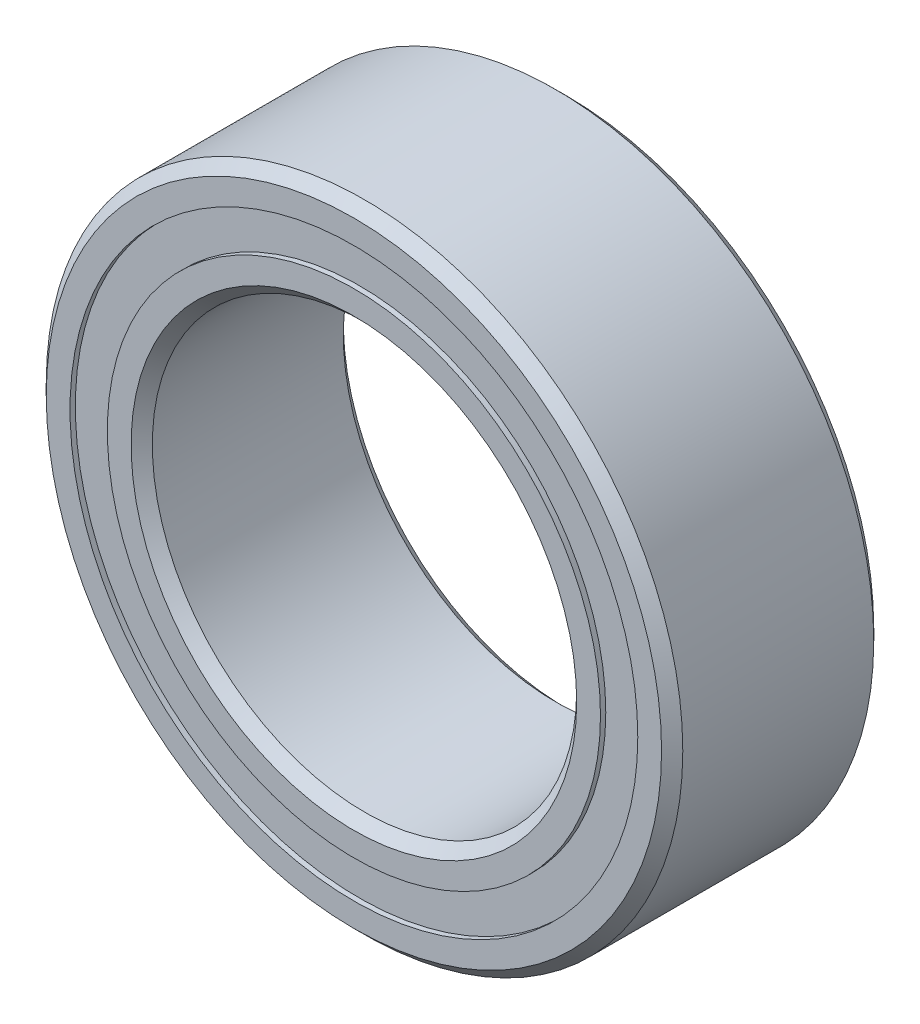
ISO-10303-21;
HEADER;
FILE_DESCRIPTION(('STEP AP214'),'2;1');
FILE_NAME('part.step','',(''),(''),'','','');
FILE_SCHEMA(('AUTOMOTIVE_DESIGN { 1 0 10303 214 1 1 1 1 }'));
ENDSEC;
DATA;
#1=APPLICATION_CONTEXT('core data for automotive mechanical design processes');
#2=APPLICATION_PROTOCOL_DEFINITION('international standard','automotive_design',2000,#1);
#3=PRODUCT_CONTEXT('',#1,'mechanical');
#4=PRODUCT('Part','Part','',(#3));
#5=PRODUCT_RELATED_PRODUCT_CATEGORY('part','',(#4));
#6=PRODUCT_DEFINITION_FORMATION('','',#4);
#7=PRODUCT_DEFINITION_CONTEXT('part definition',#1,'design');
#8=PRODUCT_DEFINITION('design','',#6,#7);
#9=PRODUCT_DEFINITION_SHAPE('','',#8);
#10=(LENGTH_UNIT() NAMED_UNIT(*) SI_UNIT(.MILLI.,.METRE.));
#11=(NAMED_UNIT(*) PLANE_ANGLE_UNIT() SI_UNIT($,.RADIAN.));
#12=(NAMED_UNIT(*) SI_UNIT($,.STERADIAN.) SOLID_ANGLE_UNIT());
#13=UNCERTAINTY_MEASURE_WITH_UNIT(LENGTH_MEASURE(1.E-05),#10,'distance_accuracy_value','');
#14=(GEOMETRIC_REPRESENTATION_CONTEXT(3) GLOBAL_UNCERTAINTY_ASSIGNED_CONTEXT((#13)) GLOBAL_UNIT_ASSIGNED_CONTEXT((#10,
#11,#12)) REPRESENTATION_CONTEXT('',''));
#15=CARTESIAN_POINT('',(0.,0.,0.));
#16=DIRECTION('',(0.,0.,1.));
#17=DIRECTION('',(1.,0.,0.));
#18=AXIS2_PLACEMENT_3D('',#15,#16,#17);
#19=CARTESIAN_POINT('',(3.96875,0.,0.));
#20=DIRECTION('',(1.,0.,0.));
#21=DIRECTION('',(0.,0.,-1.));
#22=AXIS2_PLACEMENT_3D('',#19,#20,#21);
#23=SPHERICAL_SURFACE('',#22,0.758760243513404);
#24=CARTESIAN_POINT('',(3.2099897564866,0.,0.));
#25=VERTEX_POINT('',#24);
#26=VERTEX_LOOP('',#25);
#27=FACE_BOUND('',#26,.T.);
#28=CARTESIAN_POINT('',(4.7275102435134,0.,0.));
#29=VERTEX_POINT('',#28);
#30=VERTEX_LOOP('',#29);
#31=FACE_BOUND('',#30,.T.);
#32=ADVANCED_FACE('P0_F16',(#27,#31),#23,.T.);
#33=CLOSED_SHELL('',(#32));
#34=MANIFOLD_SOLID_BREP('P0_B1',#33);
#35=CARTESIAN_POINT('',(0.,-3.96875,0.));
#36=DIRECTION('',(0.,-1.,0.));
#37=DIRECTION('',(0.,0.,-1.));
#38=AXIS2_PLACEMENT_3D('',#35,#36,#37);
#39=SPHERICAL_SURFACE('',#38,0.758760243513404);
#40=CARTESIAN_POINT('',(0.,-3.2099897564866,0.));
#41=VERTEX_POINT('',#40);
#42=VERTEX_LOOP('',#41);
#43=FACE_BOUND('',#42,.T.);
#44=CARTESIAN_POINT('',(0.,-4.7275102435134,0.));
#45=VERTEX_POINT('',#44);
#46=VERTEX_LOOP('',#45);
#47=FACE_BOUND('',#46,.T.);
#48=ADVANCED_FACE('P1_F16',(#43,#47),#39,.T.);
#49=CLOSED_SHELL('',(#48));
#50=MANIFOLD_SOLID_BREP('P1_B1',#49);
#51=CARTESIAN_POINT('',(-3.43703832126951,-1.98437499999997,0.));
#52=DIRECTION('',(-0.866025403784443,-0.499999999999992,0.));
#53=DIRECTION('',(0.,0.,-1.));
#54=AXIS2_PLACEMENT_3D('',#51,#52,#53);
#55=SPHERICAL_SURFACE('',#54,0.758760243513404);
#56=CARTESIAN_POINT('',(-4.09414396753379,-2.36375512175666,0.));
#57=VERTEX_POINT('',#56);
#58=VERTEX_LOOP('',#57);
#59=FACE_BOUND('',#58,.T.);
#60=CARTESIAN_POINT('',(-2.77993267500523,-1.60499487824327,0.));
#61=VERTEX_POINT('',#60);
#62=VERTEX_LOOP('',#61);
#63=FACE_BOUND('',#62,.T.);
#64=ADVANCED_FACE('P2_F16',(#59,#63),#55,.T.);
#65=CLOSED_SHELL('',(#64));
#66=MANIFOLD_SOLID_BREP('P2_B1',#65);
#67=CARTESIAN_POINT('',(-3.43703832126947,1.98437500000004,0.));
#68=DIRECTION('',(-0.866025403784433,0.50000000000001,0.));
#69=DIRECTION('',(0.,0.,-1.));
#70=AXIS2_PLACEMENT_3D('',#67,#68,#69);
#71=SPHERICAL_SURFACE('',#70,0.758760243513404);
#72=CARTESIAN_POINT('',(-2.7799326750052,1.60499487824333,0.));
#73=VERTEX_POINT('',#72);
#74=VERTEX_LOOP('',#73);
#75=FACE_BOUND('',#74,.T.);
#76=CARTESIAN_POINT('',(-4.09414396753374,2.36375512175675,0.));
#77=VERTEX_POINT('',#76);
#78=VERTEX_LOOP('',#77);
#79=FACE_BOUND('',#78,.T.);
#80=ADVANCED_FACE('P3_F16',(#75,#79),#71,.T.);
#81=CLOSED_SHELL('',(#80));
#82=MANIFOLD_SOLID_BREP('P3_B1',#81);
#83=CARTESIAN_POINT('',(0.,4.24787087912088,0.758760243513404));
#84=DIRECTION('',(0.,0.,1.));
#85=DIRECTION('',(1.,0.,0.));
#86=AXIS2_PLACEMENT_3D('',#83,#84,#85);
#87=PLANE('',#86);
#88=CARTESIAN_POINT('',(0.,0.,0.758760243513404));
#89=DIRECTION('',(0.,0.,1.));
#90=DIRECTION('',(1.,0.,0.));
#91=AXIS2_PLACEMENT_3D('',#88,#89,#90);
#92=CIRCLE('',#91,3.68962912087912);
#93=CARTESIAN_POINT('',(3.68962912087912,0.,0.758760243513404));
#94=VERTEX_POINT('',#93);
#95=EDGE_CURVE('P4_E18',#94,#94,#92,.T.);
#96=ORIENTED_EDGE('',*,*,#95,.T.);
#97=EDGE_LOOP('',(#96));
#98=FACE_BOUND('',#97,.T.);
#99=CARTESIAN_POINT('',(0.,0.,0.758760243513404));
#100=DIRECTION('',(0.,0.,1.));
#101=DIRECTION('',(1.,0.,0.));
#102=AXIS2_PLACEMENT_3D('',#99,#100,#101);
#103=CIRCLE('',#102,4.24787087912088);
#104=CARTESIAN_POINT('',(4.24787087912088,0.,0.758760243513404));
#105=VERTEX_POINT('',#104);
#106=EDGE_CURVE('P4_E27',#105,#105,#103,.T.);
#107=ORIENTED_EDGE('',*,*,#106,.F.);
#108=EDGE_LOOP('',(#107));
#109=FACE_BOUND('',#108,.T.);
#110=ADVANCED_FACE('P4_F15',(#98,#109),#87,.F.);
#111=CARTESIAN_POINT('',(0.,0.,1.5875));
#112=DIRECTION('',(0.,0.,1.));
#113=DIRECTION('',(1.,0.,0.));
#114=AXIS2_PLACEMENT_3D('',#111,#112,#113);
#115=CYLINDRICAL_SURFACE('',#114,3.68962912087912);
#116=ORIENTED_EDGE('',*,*,#95,.F.);
#117=EDGE_LOOP('',(#116));
#118=FACE_BOUND('',#117,.T.);
#119=CARTESIAN_POINT('',(0.,0.,1.508125));
#120=DIRECTION('',(0.,0.,1.));
#121=DIRECTION('',(1.,0.,0.));
#122=AXIS2_PLACEMENT_3D('',#119,#120,#121);
#123=CIRCLE('',#122,3.68962912087912);
#124=CARTESIAN_POINT('',(3.68962912087912,0.,1.508125));
#125=VERTEX_POINT('',#124);
#126=EDGE_CURVE('P4_E22',#125,#125,#123,.T.);
#127=ORIENTED_EDGE('',*,*,#126,.T.);
#128=EDGE_LOOP('',(#127));
#129=FACE_BOUND('',#128,.T.);
#130=ADVANCED_FACE('P4_F37',(#118,#129),#115,.F.);
#131=CARTESIAN_POINT('',(0.,0.,1.5875));
#132=DIRECTION('',(0.,0.,1.));
#133=DIRECTION('',(1.,0.,0.));
#134=AXIS2_PLACEMENT_3D('',#131,#132,#133);
#135=CYLINDRICAL_SURFACE('',#134,4.24787087912088);
#136=CARTESIAN_POINT('',(0.,0.,1.508125));
#137=DIRECTION('',(0.,0.,1.));
#138=DIRECTION('',(1.,0.,0.));
#139=AXIS2_PLACEMENT_3D('',#136,#137,#138);
#140=CIRCLE('',#139,4.24787087912088);
#141=CARTESIAN_POINT('',(4.24787087912088,0.,1.508125));
#142=VERTEX_POINT('',#141);
#143=EDGE_CURVE('P4_E10',#142,#142,#140,.F.);
#144=ORIENTED_EDGE('',*,*,#143,.T.);
#145=EDGE_LOOP('',(#144));
#146=FACE_BOUND('',#145,.T.);
#147=ORIENTED_EDGE('',*,*,#106,.T.);
#148=EDGE_LOOP('',(#147));
#149=FACE_BOUND('',#148,.T.);
#150=ADVANCED_FACE('P4_F40',(#146,#149),#135,.T.);
#151=CARTESIAN_POINT('',(0.,4.24787087912088,1.508125));
#152=DIRECTION('',(0.,0.,-1.));
#153=DIRECTION('',(-1.,0.,0.));
#154=AXIS2_PLACEMENT_3D('',#151,#152,#153);
#155=PLANE('',#154);
#156=ORIENTED_EDGE('',*,*,#143,.F.);
#157=EDGE_LOOP('',(#156));
#158=FACE_BOUND('',#157,.T.);
#159=ORIENTED_EDGE('',*,*,#126,.F.);
#160=EDGE_LOOP('',(#159));
#161=FACE_BOUND('',#160,.T.);
#162=ADVANCED_FACE('P4_F43',(#158,#161),#155,.F.);
#163=CLOSED_SHELL('',(#110,#130,#150,#162));
#164=MANIFOLD_SOLID_BREP('P4_B1',#163);
#165=CARTESIAN_POINT('',(0.,4.24787087912088,-1.508125));
#166=DIRECTION('',(0.,0.,1.));
#167=DIRECTION('',(1.,0.,0.));
#168=AXIS2_PLACEMENT_3D('',#165,#166,#167);
#169=PLANE('',#168);
#170=CARTESIAN_POINT('',(0.,0.,-1.508125));
#171=DIRECTION('',(0.,0.,1.));
#172=DIRECTION('',(1.,0.,0.));
#173=AXIS2_PLACEMENT_3D('',#170,#171,#172);
#174=CIRCLE('',#173,3.68962912087912);
#175=CARTESIAN_POINT('',(3.68962912087912,0.,-1.508125));
#176=VERTEX_POINT('',#175);
#177=EDGE_CURVE('P5_E18',#176,#176,#174,.T.);
#178=ORIENTED_EDGE('',*,*,#177,.T.);
#179=EDGE_LOOP('',(#178));
#180=FACE_BOUND('',#179,.T.);
#181=CARTESIAN_POINT('',(0.,0.,-1.508125));
#182=DIRECTION('',(0.,0.,1.));
#183=DIRECTION('',(1.,0.,0.));
#184=AXIS2_PLACEMENT_3D('',#181,#182,#183);
#185=CIRCLE('',#184,4.24787087912088);
#186=CARTESIAN_POINT('',(4.24787087912088,0.,-1.508125));
#187=VERTEX_POINT('',#186);
#188=EDGE_CURVE('P5_E27',#187,#187,#185,.T.);
#189=ORIENTED_EDGE('',*,*,#188,.F.);
#190=EDGE_LOOP('',(#189));
#191=FACE_BOUND('',#190,.T.);
#192=ADVANCED_FACE('P5_F15',(#180,#191),#169,.F.);
#193=CARTESIAN_POINT('',(0.,0.,1.5875));
#194=DIRECTION('',(0.,0.,1.));
#195=DIRECTION('',(1.,0.,0.));
#196=AXIS2_PLACEMENT_3D('',#193,#194,#195);
#197=CYLINDRICAL_SURFACE('',#196,3.68962912087912);
#198=ORIENTED_EDGE('',*,*,#177,.F.);
#199=EDGE_LOOP('',(#198));
#200=FACE_BOUND('',#199,.T.);
#201=CARTESIAN_POINT('',(0.,0.,-0.758760243513405));
#202=DIRECTION('',(0.,0.,1.));
#203=DIRECTION('',(1.,0.,0.));
#204=AXIS2_PLACEMENT_3D('',#201,#202,#203);
#205=CIRCLE('',#204,3.68962912087912);
#206=CARTESIAN_POINT('',(3.68962912087912,0.,-0.758760243513405));
#207=VERTEX_POINT('',#206);
#208=EDGE_CURVE('P5_E22',#207,#207,#205,.T.);
#209=ORIENTED_EDGE('',*,*,#208,.T.);
#210=EDGE_LOOP('',(#209));
#211=FACE_BOUND('',#210,.T.);
#212=ADVANCED_FACE('P5_F37',(#200,#211),#197,.F.);
#213=CARTESIAN_POINT('',(0.,0.,1.5875));
#214=DIRECTION('',(0.,0.,1.));
#215=DIRECTION('',(1.,0.,0.));
#216=AXIS2_PLACEMENT_3D('',#213,#214,#215);
#217=CYLINDRICAL_SURFACE('',#216,4.24787087912088);
#218=CARTESIAN_POINT('',(0.,0.,-0.758760243513404));
#219=DIRECTION('',(0.,0.,1.));
#220=DIRECTION('',(1.,0.,0.));
#221=AXIS2_PLACEMENT_3D('',#218,#219,#220);
#222=CIRCLE('',#221,4.24787087912088);
#223=CARTESIAN_POINT('',(4.24787087912088,0.,-0.758760243513404));
#224=VERTEX_POINT('',#223);
#225=EDGE_CURVE('P5_E10',#224,#224,#222,.F.);
#226=ORIENTED_EDGE('',*,*,#225,.T.);
#227=EDGE_LOOP('',(#226));
#228=FACE_BOUND('',#227,.T.);
#229=ORIENTED_EDGE('',*,*,#188,.T.);
#230=EDGE_LOOP('',(#229));
#231=FACE_BOUND('',#230,.T.);
#232=ADVANCED_FACE('P5_F40',(#228,#231),#217,.T.);
#233=CARTESIAN_POINT('',(0.,4.24787087912088,-0.758760243513404));
#234=DIRECTION('',(0.,0.,-1.));
#235=DIRECTION('',(-1.,0.,0.));
#236=AXIS2_PLACEMENT_3D('',#233,#234,#235);
#237=PLANE('',#236);
#238=ORIENTED_EDGE('',*,*,#225,.F.);
#239=EDGE_LOOP('',(#238));
#240=FACE_BOUND('',#239,.T.);
#241=ORIENTED_EDGE('',*,*,#208,.F.);
#242=EDGE_LOOP('',(#241));
#243=FACE_BOUND('',#242,.T.);
#244=ADVANCED_FACE('P5_F43',(#240,#243),#237,.F.);
#245=CLOSED_SHELL('',(#192,#212,#232,#244));
#246=MANIFOLD_SOLID_BREP('P5_B1',#245);
#247=CARTESIAN_POINT('',(-3.96875,0.,0.));
#248=DIRECTION('',(-1.,0.,0.));
#249=DIRECTION('',(0.,0.,-1.));
#250=AXIS2_PLACEMENT_3D('',#247,#248,#249);
#251=SPHERICAL_SURFACE('',#250,0.758760243513404);
#252=CARTESIAN_POINT('',(-4.7275102435134,0.,0.));
#253=VERTEX_POINT('',#252);
#254=VERTEX_LOOP('',#253);
#255=FACE_BOUND('',#254,.T.);
#256=CARTESIAN_POINT('',(-3.2099897564866,0.,0.));
#257=VERTEX_POINT('',#256);
#258=VERTEX_LOOP('',#257);
#259=FACE_BOUND('',#258,.T.);
#260=ADVANCED_FACE('P6_F16',(#255,#259),#251,.T.);
#261=CLOSED_SHELL('',(#260));
#262=MANIFOLD_SOLID_BREP('P6_B1',#261);
#263=CARTESIAN_POINT('',(0.,3.96875,0.));
#264=DIRECTION('',(0.,1.,0.));
#265=DIRECTION('',(0.,0.,-1.));
#266=AXIS2_PLACEMENT_3D('',#263,#264,#265);
#267=SPHERICAL_SURFACE('',#266,0.758760243513404);
#268=CARTESIAN_POINT('',(0.,3.2099897564866,0.));
#269=VERTEX_POINT('',#268);
#270=VERTEX_LOOP('',#269);
#271=FACE_BOUND('',#270,.T.);
#272=CARTESIAN_POINT('',(0.,4.7275102435134,0.));
#273=VERTEX_POINT('',#272);
#274=VERTEX_LOOP('',#273);
#275=FACE_BOUND('',#274,.T.);
#276=ADVANCED_FACE('P7_F16',(#271,#275),#267,.T.);
#277=CLOSED_SHELL('',(#276));
#278=MANIFOLD_SOLID_BREP('P7_B1',#277);
#279=CARTESIAN_POINT('',(-1.98437499999996,3.43703832126952,0.));
#280=DIRECTION('',(-0.499999999999989,0.866025403784445,0.));
#281=DIRECTION('',(0.,0.,-1.));
#282=AXIS2_PLACEMENT_3D('',#279,#280,#281);
#283=SPHERICAL_SURFACE('',#282,0.758760243513404);
#284=CARTESIAN_POINT('',(-2.36375512175665,4.0941439675338,0.));
#285=VERTEX_POINT('',#284);
#286=VERTEX_LOOP('',#285);
#287=FACE_BOUND('',#286,.T.);
#288=CARTESIAN_POINT('',(-1.60499487824326,2.77993267500524,0.));
#289=VERTEX_POINT('',#288);
#290=VERTEX_LOOP('',#289);
#291=FACE_BOUND('',#290,.T.);
#292=ADVANCED_FACE('P8_F16',(#287,#291),#283,.T.);
#293=CLOSED_SHELL('',(#292));
#294=MANIFOLD_SOLID_BREP('P8_B1',#293);
#295=CARTESIAN_POINT('',(3.4370383212695,1.98437499999999,0.));
#296=DIRECTION('',(0.86602540378444,0.499999999999998,0.));
#297=DIRECTION('',(0.,0.,-1.));
#298=AXIS2_PLACEMENT_3D('',#295,#296,#297);
#299=SPHERICAL_SURFACE('',#298,0.758760243513404);
#300=CARTESIAN_POINT('',(4.09414396753377,2.36375512175669,0.));
#301=VERTEX_POINT('',#300);
#302=VERTEX_LOOP('',#301);
#303=FACE_BOUND('',#302,.T.);
#304=CARTESIAN_POINT('',(2.77993267500522,1.60499487824329,0.));
#305=VERTEX_POINT('',#304);
#306=VERTEX_LOOP('',#305);
#307=FACE_BOUND('',#306,.T.);
#308=ADVANCED_FACE('P9_F16',(#303,#307),#299,.T.);
#309=CLOSED_SHELL('',(#308));
#310=MANIFOLD_SOLID_BREP('P9_B1',#309);
#311=CARTESIAN_POINT('',(1.984375,3.43703832126949,0.));
#312=DIRECTION('',(0.500000000000001,0.866025403784438,0.));
#313=DIRECTION('',(0.,0.,-1.));
#314=AXIS2_PLACEMENT_3D('',#311,#312,#313);
#315=SPHERICAL_SURFACE('',#314,0.758760243513404);
#316=CARTESIAN_POINT('',(2.36375512175671,4.09414396753376,0.));
#317=VERTEX_POINT('',#316);
#318=VERTEX_LOOP('',#317);
#319=FACE_BOUND('',#318,.T.);
#320=CARTESIAN_POINT('',(1.6049948782433,2.77993267500521,0.));
#321=VERTEX_POINT('',#320);
#322=VERTEX_LOOP('',#321);
#323=FACE_BOUND('',#322,.T.);
#324=ADVANCED_FACE('P10_F16',(#319,#323),#315,.T.);
#325=CLOSED_SHELL('',(#324));
#326=MANIFOLD_SOLID_BREP('P10_B1',#325);
#327=CARTESIAN_POINT('',(-1.98437500000003,-3.43703832126947,0.));
#328=DIRECTION('',(-0.500000000000007,-0.866025403784435,0.));
#329=DIRECTION('',(0.,0.,-1.));
#330=AXIS2_PLACEMENT_3D('',#327,#328,#329);
#331=SPHERICAL_SURFACE('',#330,0.758760243513404);
#332=CARTESIAN_POINT('',(-1.60499487824332,-2.7799326750052,0.));
#333=VERTEX_POINT('',#332);
#334=VERTEX_LOOP('',#333);
#335=FACE_BOUND('',#334,.T.);
#336=CARTESIAN_POINT('',(-2.36375512175674,-4.09414396753375,0.));
#337=VERTEX_POINT('',#336);
#338=VERTEX_LOOP('',#337);
#339=FACE_BOUND('',#338,.T.);
#340=ADVANCED_FACE('P11_F16',(#335,#339),#331,.T.);
#341=CLOSED_SHELL('',(#340));
#342=MANIFOLD_SOLID_BREP('P11_B1',#341);
#343=CARTESIAN_POINT('',(0.,0.,0.));
#344=DIRECTION('',(0.,0.,1.));
#345=DIRECTION('',(1.,0.,0.));
#346=AXIS2_PLACEMENT_3D('',#343,#344,#345);
#347=TOROIDAL_SURFACE('',#346,3.96875,0.758760243513404);
#348=CARTESIAN_POINT('',(0.,0.,-0.705555555555556));
#349=DIRECTION('',(0.,0.,1.));
#350=DIRECTION('',(1.,0.,0.));
#351=AXIS2_PLACEMENT_3D('',#348,#349,#350);
#352=CIRCLE('',#351,4.24787087912088);
#353=CARTESIAN_POINT('',(4.24787087912088,0.,-0.705555555555556));
#354=VERTEX_POINT('',#353);
#355=EDGE_CURVE('P12_E33',#354,#354,#352,.F.);
#356=ORIENTED_EDGE('',*,*,#355,.T.);
#357=EDGE_LOOP('',(#356));
#358=FACE_BOUND('',#357,.T.);
#359=CARTESIAN_POINT('',(0.,0.,0.705555555555555));
#360=DIRECTION('',(0.,0.,1.));
#361=DIRECTION('',(1.,0.,0.));
#362=AXIS2_PLACEMENT_3D('',#359,#360,#361);
#363=CIRCLE('',#362,4.24787087912088);
#364=CARTESIAN_POINT('',(4.24787087912088,0.,0.705555555555555));
#365=VERTEX_POINT('',#364);
#366=EDGE_CURVE('P12_E31',#365,#365,#363,.T.);
#367=ORIENTED_EDGE('',*,*,#366,.T.);
#368=EDGE_LOOP('',(#367));
#369=FACE_BOUND('',#368,.T.);
#370=ADVANCED_FACE('P12_F15',(#358,#369),#347,.F.);
#371=CARTESIAN_POINT('',(0.,0.,1.5875));
#372=DIRECTION('',(0.,0.,1.));
#373=DIRECTION('',(1.,0.,0.));
#374=AXIS2_PLACEMENT_3D('',#371,#372,#373);
#375=CYLINDRICAL_SURFACE('',#374,4.24787087912088);
#376=CARTESIAN_POINT('',(0.,0.,-1.5875));
#377=DIRECTION('',(0.,0.,1.));
#378=DIRECTION('',(1.,0.,0.));
#379=AXIS2_PLACEMENT_3D('',#376,#377,#378);
#380=CIRCLE('',#379,4.24787087912088);
#381=CARTESIAN_POINT('',(4.24787087912088,0.,-1.5875));
#382=VERTEX_POINT('',#381);
#383=EDGE_CURVE('P12_E19',#382,#382,#380,.F.);
#384=ORIENTED_EDGE('',*,*,#383,.T.);
#385=EDGE_LOOP('',(#384));
#386=FACE_BOUND('',#385,.T.);
#387=ORIENTED_EDGE('',*,*,#355,.F.);
#388=EDGE_LOOP('',(#387));
#389=FACE_BOUND('',#388,.T.);
#390=ADVANCED_FACE('P12_F49',(#386,#389),#375,.F.);
#391=CARTESIAN_POINT('',(0.,0.,1.5875));
#392=DIRECTION('',(0.,0.,1.));
#393=DIRECTION('',(1.,0.,0.));
#394=AXIS2_PLACEMENT_3D('',#391,#392,#393);
#395=CYLINDRICAL_SURFACE('',#394,4.24787087912088);
#396=ORIENTED_EDGE('',*,*,#366,.F.);
#397=EDGE_LOOP('',(#396));
#398=FACE_BOUND('',#397,.T.);
#399=CARTESIAN_POINT('',(0.,0.,1.5875));
#400=DIRECTION('',(0.,0.,1.));
#401=DIRECTION('',(1.,0.,0.));
#402=AXIS2_PLACEMENT_3D('',#399,#400,#401);
#403=CIRCLE('',#402,4.24787087912088);
#404=CARTESIAN_POINT('',(4.24787087912088,0.,1.5875));
#405=VERTEX_POINT('',#404);
#406=EDGE_CURVE('P12_E42',#405,#405,#403,.T.);
#407=ORIENTED_EDGE('',*,*,#406,.T.);
#408=EDGE_LOOP('',(#407));
#409=FACE_BOUND('',#408,.T.);
#410=ADVANCED_FACE('P12_F56',(#398,#409),#395,.F.);
#411=CARTESIAN_POINT('',(0.,4.60375,-1.5875));
#412=DIRECTION('',(0.,0.,1.));
#413=DIRECTION('',(1.,0.,0.));
#414=AXIS2_PLACEMENT_3D('',#411,#412,#413);
#415=PLANE('',#414);
#416=ORIENTED_EDGE('',*,*,#383,.F.);
#417=EDGE_LOOP('',(#416));
#418=FACE_BOUND('',#417,.T.);
#419=CARTESIAN_POINT('',(0.,0.,-1.58750000002783));
#420=DIRECTION('',(0.,0.,1.));
#421=DIRECTION('',(1.,0.,0.));
#422=AXIS2_PLACEMENT_3D('',#419,#420,#421);
#423=CIRCLE('',#422,4.60375000000113);
#424=CARTESIAN_POINT('',(4.60375000000113,0.,-1.58750000002783));
#425=VERTEX_POINT('',#424);
#426=EDGE_CURVE('P12_E40',#425,#425,#423,.T.);
#427=ORIENTED_EDGE('',*,*,#426,.F.);
#428=EDGE_LOOP('',(#427));
#429=FACE_BOUND('',#428,.T.);
#430=ADVANCED_FACE('P12_F52',(#418,#429),#415,.F.);
#431=CARTESIAN_POINT('',(0.,4.60375,1.5875));
#432=DIRECTION('',(0.,0.,-1.));
#433=DIRECTION('',(-1.,0.,0.));
#434=AXIS2_PLACEMENT_3D('',#431,#432,#433);
#435=PLANE('',#434);
#436=CARTESIAN_POINT('',(0.,0.,1.58750000008467));
#437=DIRECTION('',(0.,0.,-1.));
#438=DIRECTION('',(-1.,0.,0.));
#439=AXIS2_PLACEMENT_3D('',#436,#437,#438);
#440=CIRCLE('',#439,4.60375000000113);
#441=CARTESIAN_POINT('',(-4.60375000000113,0.,1.58750000008467));
#442=VERTEX_POINT('',#441);
#443=EDGE_CURVE('P12_E28',#442,#442,#440,.T.);
#444=ORIENTED_EDGE('',*,*,#443,.F.);
#445=EDGE_LOOP('',(#444));
#446=FACE_BOUND('',#445,.T.);
#447=ORIENTED_EDGE('',*,*,#406,.F.);
#448=EDGE_LOOP('',(#447));
#449=FACE_BOUND('',#448,.T.);
#450=ADVANCED_FACE('P12_F55',(#446,#449),#435,.F.);
#451=CARTESIAN_POINT('',(0.,0.,-1.42874999994547));
#452=DIRECTION('',(0.,0.,1.));
#453=DIRECTION('',(1.,0.,0.));
#454=AXIS2_PLACEMENT_3D('',#451,#452,#453);
#455=CONICAL_SURFACE('',#454,4.76250000002665,0.785398163218414);
#456=CARTESIAN_POINT('',(0.,0.,-1.42875));
#457=DIRECTION('',(0.,0.,1.));
#458=DIRECTION('',(1.,0.,0.));
#459=AXIS2_PLACEMENT_3D('',#456,#457,#458);
#460=CIRCLE('',#459,4.7625);
#461=CARTESIAN_POINT('',(4.7625,0.,-1.42875));
#462=VERTEX_POINT('',#461);
#463=EDGE_CURVE('P12_E23',#462,#462,#460,.T.);
#464=ORIENTED_EDGE('',*,*,#463,.F.);
#465=EDGE_LOOP('',(#464));
#466=FACE_BOUND('',#465,.T.);
#467=ORIENTED_EDGE('',*,*,#426,.T.);
#468=EDGE_LOOP('',(#467));
#469=FACE_BOUND('',#468,.T.);
#470=ADVANCED_FACE('P12_F60',(#466,#469),#455,.T.);
#471=CARTESIAN_POINT('',(0.,0.,1.42875000005915));
#472=DIRECTION('',(0.,0.,-1.));
#473=DIRECTION('',(-1.,0.,0.));
#474=AXIS2_PLACEMENT_3D('',#471,#472,#473);
#475=CONICAL_SURFACE('',#474,4.7624999999698,0.785398163218414);
#476=CARTESIAN_POINT('',(0.,0.,1.42875));
#477=DIRECTION('',(0.,0.,1.));
#478=DIRECTION('',(1.,0.,0.));
#479=AXIS2_PLACEMENT_3D('',#476,#477,#478);
#480=CIRCLE('',#479,4.7625);
#481=CARTESIAN_POINT('',(4.7625,0.,1.42875));
#482=VERTEX_POINT('',#481);
#483=EDGE_CURVE('P12_E10',#482,#482,#480,.F.);
#484=ORIENTED_EDGE('',*,*,#483,.F.);
#485=EDGE_LOOP('',(#484));
#486=FACE_BOUND('',#485,.T.);
#487=ORIENTED_EDGE('',*,*,#443,.T.);
#488=EDGE_LOOP('',(#487));
#489=FACE_BOUND('',#488,.T.);
#490=ADVANCED_FACE('P12_F62',(#486,#489),#475,.T.);
#491=CARTESIAN_POINT('',(0.,0.,1.5875));
#492=DIRECTION('',(0.,0.,1.));
#493=DIRECTION('',(1.,0.,0.));
#494=AXIS2_PLACEMENT_3D('',#491,#492,#493);
#495=CYLINDRICAL_SURFACE('',#494,4.7625);
#496=ORIENTED_EDGE('',*,*,#483,.T.);
#497=EDGE_LOOP('',(#496));
#498=FACE_BOUND('',#497,.T.);
#499=ORIENTED_EDGE('',*,*,#463,.T.);
#500=EDGE_LOOP('',(#499));
#501=FACE_BOUND('',#500,.T.);
#502=ADVANCED_FACE('P12_F70',(#498,#501),#495,.T.);
#503=CLOSED_SHELL('',(#370,#390,#410,#430,#450,#470,#490,#502));
#504=MANIFOLD_SOLID_BREP('P12_B1',#503);
#505=CARTESIAN_POINT('',(1.98437499999998,-3.4370383212695,0.));
#506=DIRECTION('',(0.499999999999995,-0.866025403784442,0.));
#507=DIRECTION('',(0.,0.,-1.));
#508=AXIS2_PLACEMENT_3D('',#505,#506,#507);
#509=SPHERICAL_SURFACE('',#508,0.758760243513404);
#510=CARTESIAN_POINT('',(2.36375512175668,-4.09414396753378,0.));
#511=VERTEX_POINT('',#510);
#512=VERTEX_LOOP('',#511);
#513=FACE_BOUND('',#512,.T.);
#514=CARTESIAN_POINT('',(1.60499487824328,-2.77993267500523,0.));
#515=VERTEX_POINT('',#514);
#516=VERTEX_LOOP('',#515);
#517=FACE_BOUND('',#516,.T.);
#518=ADVANCED_FACE('P13_F16',(#513,#517),#509,.T.);
#519=CLOSED_SHELL('',(#518));
#520=MANIFOLD_SOLID_BREP('P13_B1',#519);
#521=CARTESIAN_POINT('',(3.43703832126948,-1.98437500000002,0.));
#522=DIRECTION('',(0.866025403784437,-0.500000000000004,0.));
#523=DIRECTION('',(0.,0.,-1.));
#524=AXIS2_PLACEMENT_3D('',#521,#522,#523);
#525=SPHERICAL_SURFACE('',#524,0.758760243513404);
#526=CARTESIAN_POINT('',(4.09414396753376,-2.36375512175672,0.));
#527=VERTEX_POINT('',#526);
#528=VERTEX_LOOP('',#527);
#529=FACE_BOUND('',#528,.T.);
#530=CARTESIAN_POINT('',(2.77993267500521,-1.60499487824331,0.));
#531=VERTEX_POINT('',#530);
#532=VERTEX_LOOP('',#531);
#533=FACE_BOUND('',#532,.T.);
#534=ADVANCED_FACE('P14_F16',(#529,#533),#525,.T.);
#535=CLOSED_SHELL('',(#534));
#536=MANIFOLD_SOLID_BREP('P14_B1',#535);
#537=CARTESIAN_POINT('',(0.,0.,0.));
#538=DIRECTION('',(0.,0.,1.));
#539=DIRECTION('',(1.,0.,0.));
#540=AXIS2_PLACEMENT_3D('',#537,#538,#539);
#541=TOROIDAL_SURFACE('',#540,3.96875,0.758760243513403);
#542=CARTESIAN_POINT('',(0.,0.,0.705555555555556));
#543=DIRECTION('',(0.,0.,1.));
#544=DIRECTION('',(1.,0.,0.));
#545=AXIS2_PLACEMENT_3D('',#542,#543,#544);
#546=CIRCLE('',#545,3.68962912087912);
#547=CARTESIAN_POINT('',(3.68962912087912,0.,0.705555555555556));
#548=VERTEX_POINT('',#547);
#549=EDGE_CURVE('P15_E33',#548,#548,#546,.T.);
#550=ORIENTED_EDGE('',*,*,#549,.F.);
#551=EDGE_LOOP('',(#550));
#552=FACE_BOUND('',#551,.T.);
#553=CARTESIAN_POINT('',(0.,0.,-0.705555555555556));
#554=DIRECTION('',(0.,0.,1.));
#555=DIRECTION('',(1.,0.,0.));
#556=AXIS2_PLACEMENT_3D('',#553,#554,#555);
#557=CIRCLE('',#556,3.68962912087912);
#558=CARTESIAN_POINT('',(3.68962912087912,0.,-0.705555555555556));
#559=VERTEX_POINT('',#558);
#560=EDGE_CURVE('P15_E31',#559,#559,#557,.F.);
#561=ORIENTED_EDGE('',*,*,#560,.F.);
#562=EDGE_LOOP('',(#561));
#563=FACE_BOUND('',#562,.T.);
#564=ADVANCED_FACE('P15_F15',(#552,#563),#541,.F.);
#565=CARTESIAN_POINT('',(0.,0.,1.5875));
#566=DIRECTION('',(0.,0.,1.));
#567=DIRECTION('',(1.,0.,0.));
#568=AXIS2_PLACEMENT_3D('',#565,#566,#567);
#569=CYLINDRICAL_SURFACE('',#568,3.68962912087912);
#570=CARTESIAN_POINT('',(0.,0.,1.5875));
#571=DIRECTION('',(0.,0.,1.));
#572=DIRECTION('',(1.,0.,0.));
#573=AXIS2_PLACEMENT_3D('',#570,#571,#572);
#574=CIRCLE('',#573,3.68962912087912);
#575=CARTESIAN_POINT('',(3.68962912087912,0.,1.5875));
#576=VERTEX_POINT('',#575);
#577=EDGE_CURVE('P15_E19',#576,#576,#574,.F.);
#578=ORIENTED_EDGE('',*,*,#577,.T.);
#579=EDGE_LOOP('',(#578));
#580=FACE_BOUND('',#579,.T.);
#581=ORIENTED_EDGE('',*,*,#549,.T.);
#582=EDGE_LOOP('',(#581));
#583=FACE_BOUND('',#582,.T.);
#584=ADVANCED_FACE('P15_F49',(#580,#583),#569,.T.);
#585=CARTESIAN_POINT('',(0.,0.,1.5875));
#586=DIRECTION('',(0.,0.,1.));
#587=DIRECTION('',(1.,0.,0.));
#588=AXIS2_PLACEMENT_3D('',#585,#586,#587);
#589=CYLINDRICAL_SURFACE('',#588,3.68962912087912);
#590=ORIENTED_EDGE('',*,*,#560,.T.);
#591=EDGE_LOOP('',(#590));
#592=FACE_BOUND('',#591,.T.);
#593=CARTESIAN_POINT('',(0.,0.,-1.5875));
#594=DIRECTION('',(0.,0.,1.));
#595=DIRECTION('',(1.,0.,0.));
#596=AXIS2_PLACEMENT_3D('',#593,#594,#595);
#597=CIRCLE('',#596,3.68962912087912);
#598=CARTESIAN_POINT('',(3.68962912087912,0.,-1.5875));
#599=VERTEX_POINT('',#598);
#600=EDGE_CURVE('P15_E42',#599,#599,#597,.T.);
#601=ORIENTED_EDGE('',*,*,#600,.T.);
#602=EDGE_LOOP('',(#601));
#603=FACE_BOUND('',#602,.T.);
#604=ADVANCED_FACE('P15_F56',(#592,#603),#589,.T.);
#605=CARTESIAN_POINT('',(0.,3.68962912087912,1.5875));
#606=DIRECTION('',(0.,0.,-1.));
#607=DIRECTION('',(-1.,0.,0.));
#608=AXIS2_PLACEMENT_3D('',#605,#606,#607);
#609=PLANE('',#608);
#610=ORIENTED_EDGE('',*,*,#577,.F.);
#611=EDGE_LOOP('',(#610));
#612=FACE_BOUND('',#611,.T.);
#613=CARTESIAN_POINT('',(0.,0.,1.58749999997099));
#614=DIRECTION('',(0.,0.,1.));
#615=DIRECTION('',(1.,0.,0.));
#616=AXIS2_PLACEMENT_3D('',#613,#614,#615);
#617=CIRCLE('',#616,3.33374999996749);
#618=CARTESIAN_POINT('',(3.33374999996749,0.,1.58749999997099));
#619=VERTEX_POINT('',#618);
#620=EDGE_CURVE('P15_E40',#619,#619,#617,.F.);
#621=ORIENTED_EDGE('',*,*,#620,.T.);
#622=EDGE_LOOP('',(#621));
#623=FACE_BOUND('',#622,.T.);
#624=ADVANCED_FACE('P15_F52',(#612,#623),#609,.F.);
#625=CARTESIAN_POINT('',(0.,3.33375,-1.5875));
#626=DIRECTION('',(0.,0.,1.));
#627=DIRECTION('',(1.,0.,0.));
#628=AXIS2_PLACEMENT_3D('',#625,#626,#627);
#629=PLANE('',#628);
#630=CARTESIAN_POINT('',(0.,0.,-1.58749999997099));
#631=DIRECTION('',(0.,0.,-1.));
#632=DIRECTION('',(0.,1.,0.));
#633=AXIS2_PLACEMENT_3D('',#630,#631,#632);
#634=CIRCLE('',#633,3.33375000002434);
#635=CARTESIAN_POINT('',(0.,3.33375000002434,-1.58749999997099));
#636=VERTEX_POINT('',#635);
#637=EDGE_CURVE('P15_E28',#636,#636,#634,.F.);
#638=ORIENTED_EDGE('',*,*,#637,.T.);
#639=EDGE_LOOP('',(#638));
#640=FACE_BOUND('',#639,.T.);
#641=ORIENTED_EDGE('',*,*,#600,.F.);
#642=EDGE_LOOP('',(#641));
#643=FACE_BOUND('',#642,.T.);
#644=ADVANCED_FACE('P15_F55',(#640,#643),#629,.F.);
#645=CARTESIAN_POINT('',(0.,0.,1.58749999991414));
#646=DIRECTION('',(0.,0.,1.));
#647=DIRECTION('',(1.,0.,0.));
#648=AXIS2_PLACEMENT_3D('',#645,#646,#647);
#649=CONICAL_SURFACE('',#648,3.33374999991065,0.785398163397448);
#650=ORIENTED_EDGE('',*,*,#620,.F.);
#651=EDGE_LOOP('',(#650));
#652=FACE_BOUND('',#651,.T.);
#653=CARTESIAN_POINT('',(0.,0.,1.42875));
#654=DIRECTION('',(0.,0.,1.));
#655=DIRECTION('',(1.,0.,0.));
#656=AXIS2_PLACEMENT_3D('',#653,#654,#655);
#657=CIRCLE('',#656,3.175);
#658=CARTESIAN_POINT('',(3.175,0.,1.42875));
#659=VERTEX_POINT('',#658);
#660=EDGE_CURVE('P15_E23',#659,#659,#657,.F.);
#661=ORIENTED_EDGE('',*,*,#660,.T.);
#662=EDGE_LOOP('',(#661));
#663=FACE_BOUND('',#662,.T.);
#664=ADVANCED_FACE('P15_F60',(#652,#663),#649,.F.);
#665=CARTESIAN_POINT('',(0.,0.,-1.58749999997099));
#666=DIRECTION('',(0.,0.,-1.));
#667=DIRECTION('',(0.,1.,0.));
#668=AXIS2_PLACEMENT_3D('',#665,#666,#667);
#669=CONICAL_SURFACE('',#668,3.33375000002434,0.785398163397448);
#670=CARTESIAN_POINT('',(0.,0.,-1.42875));
#671=DIRECTION('',(0.,0.,1.));
#672=DIRECTION('',(1.,0.,0.));
#673=AXIS2_PLACEMENT_3D('',#670,#671,#672);
#674=CIRCLE('',#673,3.175);
#675=CARTESIAN_POINT('',(3.175,0.,-1.42875));
#676=VERTEX_POINT('',#675);
#677=EDGE_CURVE('P15_E10',#676,#676,#674,.T.);
#678=ORIENTED_EDGE('',*,*,#677,.T.);
#679=EDGE_LOOP('',(#678));
#680=FACE_BOUND('',#679,.T.);
#681=ORIENTED_EDGE('',*,*,#637,.F.);
#682=EDGE_LOOP('',(#681));
#683=FACE_BOUND('',#682,.T.);
#684=ADVANCED_FACE('P15_F63',(#680,#683),#669,.F.);
#685=CARTESIAN_POINT('',(0.,0.,1.5875));
#686=DIRECTION('',(0.,0.,1.));
#687=DIRECTION('',(1.,0.,0.));
#688=AXIS2_PLACEMENT_3D('',#685,#686,#687);
#689=CYLINDRICAL_SURFACE('',#688,3.175);
#690=ORIENTED_EDGE('',*,*,#660,.F.);
#691=EDGE_LOOP('',(#690));
#692=FACE_BOUND('',#691,.T.);
#693=ORIENTED_EDGE('',*,*,#677,.F.);
#694=EDGE_LOOP('',(#693));
#695=FACE_BOUND('',#694,.T.);
#696=ADVANCED_FACE('P15_F67',(#692,#695),#689,.F.);
#697=CLOSED_SHELL('',(#564,#584,#604,#624,#644,#664,#684,#696));
#698=MANIFOLD_SOLID_BREP('P15_B1',#697);
#699=ADVANCED_BREP_SHAPE_REPRESENTATION('',(#18,#34,#50,#66,#82,#164,#246,#262,#278,#294,#310,
#326,#342,#504,#520,#536,#698),#14);
#700=SHAPE_DEFINITION_REPRESENTATION(#9,#699);
ENDSEC;
END-ISO-10303-21;
